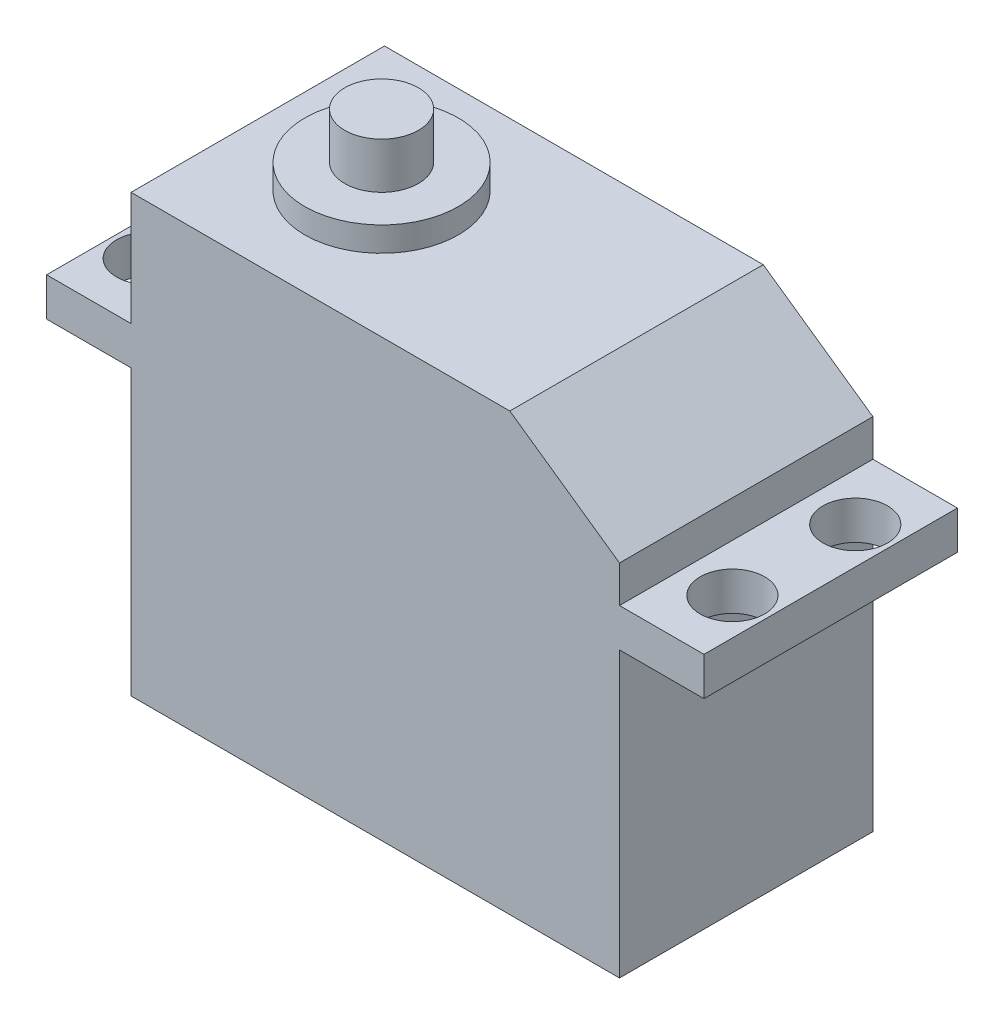
ISO-10303-21;
HEADER;
FILE_DESCRIPTION(('STEP AP214'),'2;1');
FILE_NAME('part.step','',(''),(''),'','','');
FILE_SCHEMA(('AUTOMOTIVE_DESIGN { 1 0 10303 214 1 1 1 1 }'));
ENDSEC;
DATA;
#1=APPLICATION_CONTEXT('core data for automotive mechanical design processes');
#2=APPLICATION_PROTOCOL_DEFINITION('international standard','automotive_design',2000,#1);
#3=PRODUCT_CONTEXT('',#1,'mechanical');
#4=PRODUCT('Part','Part','',(#3));
#5=PRODUCT_RELATED_PRODUCT_CATEGORY('part','',(#4));
#6=PRODUCT_DEFINITION_FORMATION('','',#4);
#7=PRODUCT_DEFINITION_CONTEXT('part definition',#1,'design');
#8=PRODUCT_DEFINITION('design','',#6,#7);
#9=PRODUCT_DEFINITION_SHAPE('','',#8);
#10=(LENGTH_UNIT() NAMED_UNIT(*) SI_UNIT(.MILLI.,.METRE.));
#11=(NAMED_UNIT(*) PLANE_ANGLE_UNIT() SI_UNIT($,.RADIAN.));
#12=(NAMED_UNIT(*) SI_UNIT($,.STERADIAN.) SOLID_ANGLE_UNIT());
#13=UNCERTAINTY_MEASURE_WITH_UNIT(LENGTH_MEASURE(1.E-05),#10,'distance_accuracy_value','');
#14=(GEOMETRIC_REPRESENTATION_CONTEXT(3) GLOBAL_UNCERTAINTY_ASSIGNED_CONTEXT((#13)) GLOBAL_UNIT_ASSIGNED_CONTEXT((#10,
#11,#12)) REPRESENTATION_CONTEXT('',''));
#15=CARTESIAN_POINT('',(0.,0.,0.));
#16=DIRECTION('',(0.,0.,1.));
#17=DIRECTION('',(1.,0.,0.));
#18=AXIS2_PLACEMENT_3D('',#15,#16,#17);
#19=CARTESIAN_POINT('',(-15.9,28.4,-8.25));
#20=DIRECTION('',(1.,0.,0.));
#21=DIRECTION('',(0.,0.,-1.));
#22=AXIS2_PLACEMENT_3D('',#19,#20,#21);
#23=PLANE('',#22);
#24=DIRECTION('',(0.,-1.,0.));
#25=VECTOR('',#24,1.);
#26=CARTESIAN_POINT('',(-15.9,28.4,8.25));
#27=LINE('',#26,#25);
#28=CARTESIAN_POINT('',(-15.9,18.5,8.25));
#29=VERTEX_POINT('',#28);
#30=CARTESIAN_POINT('',(-15.9,0.,8.25));
#31=VERTEX_POINT('',#30);
#32=EDGE_CURVE('E216',#29,#31,#27,.T.);
#33=ORIENTED_EDGE('',*,*,#32,.F.);
#34=DIRECTION('',(0.,0.,-1.));
#35=VECTOR('',#34,1.);
#36=CARTESIAN_POINT('',(-15.9,18.5,8.25));
#37=LINE('',#36,#35);
#38=CARTESIAN_POINT('',(-15.9,18.5,-8.25));
#39=VERTEX_POINT('',#38);
#40=EDGE_CURVE('E149',#29,#39,#37,.T.);
#41=ORIENTED_EDGE('',*,*,#40,.T.);
#42=DIRECTION('',(0.,-1.,0.));
#43=VECTOR('',#42,1.);
#44=CARTESIAN_POINT('',(-15.9,28.4,-8.25));
#45=LINE('',#44,#43);
#46=CARTESIAN_POINT('',(-15.9,0.,-8.25));
#47=VERTEX_POINT('',#46);
#48=EDGE_CURVE('E218',#39,#47,#45,.T.);
#49=ORIENTED_EDGE('',*,*,#48,.T.);
#50=DIRECTION('',(0.,0.,1.));
#51=VECTOR('',#50,1.);
#52=CARTESIAN_POINT('',(-15.9,0.,-8.25));
#53=LINE('',#52,#51);
#54=EDGE_CURVE('E209',#47,#31,#53,.T.);
#55=ORIENTED_EDGE('',*,*,#54,.T.);
#56=EDGE_LOOP('',(#33,#41,#49,#55));
#57=FACE_BOUND('',#56,.T.);
#58=ADVANCED_FACE('F33',(#57),#23,.F.);
#59=CARTESIAN_POINT('',(15.9,28.4,-8.25));
#60=DIRECTION('',(-1.,0.,0.));
#61=DIRECTION('',(0.,0.,1.));
#62=AXIS2_PLACEMENT_3D('',#59,#60,#61);
#63=PLANE('',#62);
#64=DIRECTION('',(0.,-1.,0.));
#65=VECTOR('',#64,1.);
#66=CARTESIAN_POINT('',(15.9,28.4,-8.25));
#67=LINE('',#66,#65);
#68=CARTESIAN_POINT('',(15.9,23.4,-8.25));
#69=VERTEX_POINT('',#68);
#70=CARTESIAN_POINT('',(15.9,21.,-8.25));
#71=VERTEX_POINT('',#70);
#72=EDGE_CURVE('E223',#69,#71,#67,.T.);
#73=ORIENTED_EDGE('',*,*,#72,.F.);
#74=DIRECTION('',(0.,0.,1.));
#75=VECTOR('',#74,1.);
#76=CARTESIAN_POINT('',(15.9,23.4,8.25));
#77=LINE('',#76,#75);
#78=CARTESIAN_POINT('',(15.9,23.4,8.25));
#79=VERTEX_POINT('',#78);
#80=EDGE_CURVE('E41',#69,#79,#77,.T.);
#81=ORIENTED_EDGE('',*,*,#80,.T.);
#82=DIRECTION('',(0.,-1.,0.));
#83=VECTOR('',#82,1.);
#84=CARTESIAN_POINT('',(15.9,28.4,8.25));
#85=LINE('',#84,#83);
#86=CARTESIAN_POINT('',(15.9,21.,8.25));
#87=VERTEX_POINT('',#86);
#88=EDGE_CURVE('E214',#79,#87,#85,.T.);
#89=ORIENTED_EDGE('',*,*,#88,.T.);
#90=DIRECTION('',(0.,0.,1.));
#91=VECTOR('',#90,1.);
#92=CARTESIAN_POINT('',(15.9,21.,8.25));
#93=LINE('',#92,#91);
#94=EDGE_CURVE('E172',#71,#87,#93,.T.);
#95=ORIENTED_EDGE('',*,*,#94,.F.);
#96=EDGE_LOOP('',(#73,#81,#89,#95));
#97=FACE_BOUND('',#96,.T.);
#98=ADVANCED_FACE('F285',(#97),#63,.F.);
#99=DIRECTION('',(0.,0.,-1.));
#100=VECTOR('',#99,1.);
#101=CARTESIAN_POINT('',(15.9,18.5,8.25));
#102=LINE('',#101,#100);
#103=CARTESIAN_POINT('',(15.9,18.5,8.25));
#104=VERTEX_POINT('',#103);
#105=CARTESIAN_POINT('',(15.9,18.5,-8.25));
#106=VERTEX_POINT('',#105);
#107=EDGE_CURVE('E138',#104,#106,#102,.T.);
#108=ORIENTED_EDGE('',*,*,#107,.F.);
#109=CARTESIAN_POINT('',(15.9,0.,8.25));
#110=VERTEX_POINT('',#109);
#111=EDGE_CURVE('E203',#104,#110,#85,.T.);
#112=ORIENTED_EDGE('',*,*,#111,.T.);
#113=DIRECTION('',(0.,0.,-1.));
#114=VECTOR('',#113,1.);
#115=CARTESIAN_POINT('',(15.9,0.,-8.25));
#116=LINE('',#115,#114);
#117=CARTESIAN_POINT('',(15.9,0.,-8.25));
#118=VERTEX_POINT('',#117);
#119=EDGE_CURVE('E194',#110,#118,#116,.T.);
#120=ORIENTED_EDGE('',*,*,#119,.T.);
#121=EDGE_CURVE('E222',#106,#118,#67,.T.);
#122=ORIENTED_EDGE('',*,*,#121,.F.);
#123=EDGE_LOOP('',(#108,#112,#120,#122));
#124=FACE_BOUND('',#123,.T.);
#125=ADVANCED_FACE('F292',(#124),#63,.F.);
#126=CARTESIAN_POINT('',(-15.9,28.4,-8.25));
#127=DIRECTION('',(0.,0.,1.));
#128=DIRECTION('',(1.,0.,0.));
#129=AXIS2_PLACEMENT_3D('',#126,#127,#128);
#130=PLANE('',#129);
#131=DIRECTION('',(-1.,0.,0.));
#132=VECTOR('',#131,1.);
#133=CARTESIAN_POINT('',(-15.9,28.4,-8.25));
#134=LINE('',#133,#132);
#135=CARTESIAN_POINT('',(8.75925996628941,28.4,-8.25));
#136=VERTEX_POINT('',#135);
#137=CARTESIAN_POINT('',(-15.9,28.4,-8.25));
#138=VERTEX_POINT('',#137);
#139=EDGE_CURVE('E195',#136,#138,#134,.T.);
#140=ORIENTED_EDGE('',*,*,#139,.F.);
#141=DIRECTION('',(0.819152044288991,-0.573576436351047,0.));
#142=VECTOR('',#141,1.);
#143=CARTESIAN_POINT('',(8.75925996628942,28.4,-8.25));
#144=LINE('',#143,#142);
#145=EDGE_CURVE('E55',#136,#69,#144,.T.);
#146=ORIENTED_EDGE('',*,*,#145,.T.);
#147=ORIENTED_EDGE('',*,*,#72,.T.);
#148=DIRECTION('',(-1.,0.,0.));
#149=VECTOR('',#148,1.);
#150=CARTESIAN_POINT('',(21.4,21.,-8.25000000000001));
#151=LINE('',#150,#149);
#152=CARTESIAN_POINT('',(21.4,21.,-8.25000000000001));
#153=VERTEX_POINT('',#152);
#154=EDGE_CURVE('E185',#153,#71,#151,.T.);
#155=ORIENTED_EDGE('',*,*,#154,.F.);
#156=DIRECTION('',(0.,1.,0.));
#157=VECTOR('',#156,1.);
#158=CARTESIAN_POINT('',(21.4,18.5,-8.25000000000001));
#159=LINE('',#158,#157);
#160=CARTESIAN_POINT('',(21.4,18.5,-8.25000000000001));
#161=VERTEX_POINT('',#160);
#162=EDGE_CURVE('E174',#161,#153,#159,.T.);
#163=ORIENTED_EDGE('',*,*,#162,.F.);
#164=DIRECTION('',(-1.,0.,0.));
#165=VECTOR('',#164,1.);
#166=CARTESIAN_POINT('',(21.4,18.5,-8.25000000000001));
#167=LINE('',#166,#165);
#168=EDGE_CURVE('E188',#161,#106,#167,.T.);
#169=ORIENTED_EDGE('',*,*,#168,.T.);
#170=ORIENTED_EDGE('',*,*,#121,.T.);
#171=DIRECTION('',(-1.,0.,0.));
#172=VECTOR('',#171,1.);
#173=CARTESIAN_POINT('',(-15.9,0.,-8.25));
#174=LINE('',#173,#172);
#175=EDGE_CURVE('E206',#118,#47,#174,.T.);
#176=ORIENTED_EDGE('',*,*,#175,.T.);
#177=ORIENTED_EDGE('',*,*,#48,.F.);
#178=DIRECTION('',(1.,0.,0.));
#179=VECTOR('',#178,1.);
#180=CARTESIAN_POINT('',(-21.4,18.5,-8.25000000000001));
#181=LINE('',#180,#179);
#182=CARTESIAN_POINT('',(-21.4,18.5,-8.25000000000001));
#183=VERTEX_POINT('',#182);
#184=EDGE_CURVE('E165',#183,#39,#181,.T.);
#185=ORIENTED_EDGE('',*,*,#184,.F.);
#186=DIRECTION('',(0.,1.,0.));
#187=VECTOR('',#186,1.);
#188=CARTESIAN_POINT('',(-21.4,18.5,-8.25000000000001));
#189=LINE('',#188,#187);
#190=CARTESIAN_POINT('',(-21.4,21.,-8.25000000000001));
#191=VERTEX_POINT('',#190);
#192=EDGE_CURVE('E152',#183,#191,#189,.T.);
#193=ORIENTED_EDGE('',*,*,#192,.T.);
#194=DIRECTION('',(1.,0.,0.));
#195=VECTOR('',#194,1.);
#196=CARTESIAN_POINT('',(-21.4,21.,-8.25000000000001));
#197=LINE('',#196,#195);
#198=CARTESIAN_POINT('',(-15.9,21.,-8.25));
#199=VERTEX_POINT('',#198);
#200=EDGE_CURVE('E139',#191,#199,#197,.T.);
#201=ORIENTED_EDGE('',*,*,#200,.T.);
#202=EDGE_CURVE('E219',#138,#199,#45,.T.);
#203=ORIENTED_EDGE('',*,*,#202,.F.);
#204=EDGE_LOOP('',(#140,#146,#147,#155,#163,#169,#170,#176,#177,#185,#193,#201,#203));
#205=FACE_BOUND('',#204,.T.);
#206=ADVANCED_FACE('F297',(#205),#130,.F.);
#207=ORIENTED_EDGE('',*,*,#202,.T.);
#208=DIRECTION('',(0.,0.,1.));
#209=VECTOR('',#208,1.);
#210=CARTESIAN_POINT('',(-15.9,21.,8.25));
#211=LINE('',#210,#209);
#212=CARTESIAN_POINT('',(-15.9,21.,8.25));
#213=VERTEX_POINT('',#212);
#214=EDGE_CURVE('E159',#199,#213,#211,.T.);
#215=ORIENTED_EDGE('',*,*,#214,.T.);
#216=CARTESIAN_POINT('',(-15.9,28.4,8.25));
#217=VERTEX_POINT('',#216);
#218=EDGE_CURVE('E133',#217,#213,#27,.T.);
#219=ORIENTED_EDGE('',*,*,#218,.F.);
#220=DIRECTION('',(0.,0.,1.));
#221=VECTOR('',#220,1.);
#222=CARTESIAN_POINT('',(-15.9,28.4,-8.25));
#223=LINE('',#222,#221);
#224=EDGE_CURVE('E197',#138,#217,#223,.T.);
#225=ORIENTED_EDGE('',*,*,#224,.F.);
#226=EDGE_LOOP('',(#207,#215,#219,#225));
#227=FACE_BOUND('',#226,.T.);
#228=ADVANCED_FACE('F288',(#227),#23,.F.);
#229=CARTESIAN_POINT('',(-15.9,28.4,8.25));
#230=DIRECTION('',(0.,0.,-1.));
#231=DIRECTION('',(-1.,0.,0.));
#232=AXIS2_PLACEMENT_3D('',#229,#230,#231);
#233=PLANE('',#232);
#234=ORIENTED_EDGE('',*,*,#88,.F.);
#235=DIRECTION('',(-0.819152044288991,0.573576436351047,0.));
#236=VECTOR('',#235,1.);
#237=CARTESIAN_POINT('',(8.75925996628942,28.4,8.25));
#238=LINE('',#237,#236);
#239=CARTESIAN_POINT('',(8.75925996628942,28.4,8.25));
#240=VERTEX_POINT('',#239);
#241=EDGE_CURVE('E11',#79,#240,#238,.T.);
#242=ORIENTED_EDGE('',*,*,#241,.T.);
#243=DIRECTION('',(1.,0.,0.));
#244=VECTOR('',#243,1.);
#245=CARTESIAN_POINT('',(-15.9,28.4,8.25));
#246=LINE('',#245,#244);
#247=EDGE_CURVE('E200',#217,#240,#246,.T.);
#248=ORIENTED_EDGE('',*,*,#247,.F.);
#249=ORIENTED_EDGE('',*,*,#218,.T.);
#250=DIRECTION('',(1.,0.,0.));
#251=VECTOR('',#250,1.);
#252=CARTESIAN_POINT('',(-21.4,21.,8.24999999999999));
#253=LINE('',#252,#251);
#254=CARTESIAN_POINT('',(-21.4,21.,8.24999999999999));
#255=VERTEX_POINT('',#254);
#256=EDGE_CURVE('E126',#255,#213,#253,.T.);
#257=ORIENTED_EDGE('',*,*,#256,.F.);
#258=DIRECTION('',(0.,-1.,0.));
#259=VECTOR('',#258,1.);
#260=CARTESIAN_POINT('',(-21.4,18.5,8.24999999999999));
#261=LINE('',#260,#259);
#262=CARTESIAN_POINT('',(-21.4,18.5,8.24999999999999));
#263=VERTEX_POINT('',#262);
#264=EDGE_CURVE('E129',#255,#263,#261,.T.);
#265=ORIENTED_EDGE('',*,*,#264,.T.);
#266=DIRECTION('',(1.,0.,0.));
#267=VECTOR('',#266,1.);
#268=CARTESIAN_POINT('',(-21.4,18.5,8.24999999999999));
#269=LINE('',#268,#267);
#270=EDGE_CURVE('E158',#263,#29,#269,.T.);
#271=ORIENTED_EDGE('',*,*,#270,.T.);
#272=ORIENTED_EDGE('',*,*,#32,.T.);
#273=DIRECTION('',(1.,0.,0.));
#274=VECTOR('',#273,1.);
#275=CARTESIAN_POINT('',(-15.9,0.,8.25));
#276=LINE('',#275,#274);
#277=EDGE_CURVE('E198',#31,#110,#276,.T.);
#278=ORIENTED_EDGE('',*,*,#277,.T.);
#279=ORIENTED_EDGE('',*,*,#111,.F.);
#280=DIRECTION('',(-1.,0.,0.));
#281=VECTOR('',#280,1.);
#282=CARTESIAN_POINT('',(21.4,18.5,8.24999999999999));
#283=LINE('',#282,#281);
#284=CARTESIAN_POINT('',(21.4,18.5,8.24999999999999));
#285=VERTEX_POINT('',#284);
#286=EDGE_CURVE('E191',#285,#104,#283,.T.);
#287=ORIENTED_EDGE('',*,*,#286,.F.);
#288=DIRECTION('',(0.,-1.,0.));
#289=VECTOR('',#288,1.);
#290=CARTESIAN_POINT('',(21.4,18.5,8.24999999999999));
#291=LINE('',#290,#289);
#292=CARTESIAN_POINT('',(21.4,21.,8.24999999999999));
#293=VERTEX_POINT('',#292);
#294=EDGE_CURVE('E168',#293,#285,#291,.T.);
#295=ORIENTED_EDGE('',*,*,#294,.F.);
#296=DIRECTION('',(-1.,0.,0.));
#297=VECTOR('',#296,1.);
#298=CARTESIAN_POINT('',(21.4,21.,8.24999999999999));
#299=LINE('',#298,#297);
#300=EDGE_CURVE('E178',#293,#87,#299,.T.);
#301=ORIENTED_EDGE('',*,*,#300,.T.);
#302=EDGE_LOOP('',(#234,#242,#248,#249,#257,#265,#271,#272,#278,#279,#287,#295,#301));
#303=FACE_BOUND('',#302,.T.);
#304=ADVANCED_FACE('F128',(#303),#233,.F.);
#305=CARTESIAN_POINT('',(0.,28.4,0.));
#306=DIRECTION('',(0.,1.,0.));
#307=DIRECTION('',(0.,0.,1.));
#308=AXIS2_PLACEMENT_3D('',#305,#306,#307);
#309=PLANE('',#308);
#310=CARTESIAN_POINT('',(-7.84,28.4,0.));
#311=DIRECTION('',(0.,1.,0.));
#312=DIRECTION('',(0.,0.,1.));
#313=AXIS2_PLACEMENT_3D('',#310,#311,#312);
#314=CIRCLE('',#313,5.);
#315=CARTESIAN_POINT('',(-7.84,28.4,5.));
#316=VERTEX_POINT('',#315);
#317=EDGE_CURVE('E242',#316,#316,#314,.T.);
#318=ORIENTED_EDGE('',*,*,#317,.F.);
#319=EDGE_LOOP('',(#318));
#320=FACE_BOUND('',#319,.T.);
#321=ORIENTED_EDGE('',*,*,#247,.T.);
#322=DIRECTION('',(0.,0.,-1.));
#323=VECTOR('',#322,1.);
#324=CARTESIAN_POINT('',(8.75925996628941,28.4,-8.25));
#325=LINE('',#324,#323);
#326=EDGE_CURVE('E226',#240,#136,#325,.T.);
#327=ORIENTED_EDGE('',*,*,#326,.T.);
#328=ORIENTED_EDGE('',*,*,#139,.T.);
#329=ORIENTED_EDGE('',*,*,#224,.T.);
#330=EDGE_LOOP('',(#321,#327,#328,#329));
#331=FACE_BOUND('',#330,.T.);
#332=ADVANCED_FACE('F303',(#320,#331),#309,.T.);
#333=CARTESIAN_POINT('',(0.,0.,0.));
#334=DIRECTION('',(0.,1.,0.));
#335=DIRECTION('',(0.,0.,1.));
#336=AXIS2_PLACEMENT_3D('',#333,#334,#335);
#337=PLANE('',#336);
#338=ORIENTED_EDGE('',*,*,#119,.F.);
#339=ORIENTED_EDGE('',*,*,#277,.F.);
#340=ORIENTED_EDGE('',*,*,#54,.F.);
#341=ORIENTED_EDGE('',*,*,#175,.F.);
#342=EDGE_LOOP('',(#338,#339,#340,#341));
#343=FACE_BOUND('',#342,.T.);
#344=ADVANCED_FACE('F314',(#343),#337,.F.);
#345=CARTESIAN_POINT('',(21.4,18.5,8.24999999999999));
#346=DIRECTION('',(0.,1.,0.));
#347=DIRECTION('',(0.,0.,1.));
#348=AXIS2_PLACEMENT_3D('',#345,#346,#347);
#349=PLANE('',#348);
#350=CARTESIAN_POINT('',(19.,18.5,-4.));
#351=DIRECTION('',(0.,-1.,0.));
#352=DIRECTION('',(0.,0.,-1.));
#353=AXIS2_PLACEMENT_3D('',#350,#351,#352);
#354=CIRCLE('',#353,2.1);
#355=CARTESIAN_POINT('',(19.,18.5,-6.1));
#356=VERTEX_POINT('',#355);
#357=EDGE_CURVE('E255',#356,#356,#354,.F.);
#358=ORIENTED_EDGE('',*,*,#357,.T.);
#359=EDGE_LOOP('',(#358));
#360=FACE_BOUND('',#359,.T.);
#361=CARTESIAN_POINT('',(19.,18.5,4.));
#362=DIRECTION('',(0.,-1.,0.));
#363=DIRECTION('',(0.,0.,-1.));
#364=AXIS2_PLACEMENT_3D('',#361,#362,#363);
#365=CIRCLE('',#364,2.1);
#366=CARTESIAN_POINT('',(19.,18.5,1.9));
#367=VERTEX_POINT('',#366);
#368=EDGE_CURVE('E247',#367,#367,#365,.F.);
#369=ORIENTED_EDGE('',*,*,#368,.T.);
#370=EDGE_LOOP('',(#369));
#371=FACE_BOUND('',#370,.T.);
#372=ORIENTED_EDGE('',*,*,#107,.T.);
#373=ORIENTED_EDGE('',*,*,#168,.F.);
#374=DIRECTION('',(0.,0.,-1.));
#375=VECTOR('',#374,1.);
#376=CARTESIAN_POINT('',(21.4,18.5,8.24999999999999));
#377=LINE('',#376,#375);
#378=EDGE_CURVE('E171',#285,#161,#377,.T.);
#379=ORIENTED_EDGE('',*,*,#378,.F.);
#380=ORIENTED_EDGE('',*,*,#286,.T.);
#381=EDGE_LOOP('',(#372,#373,#379,#380));
#382=FACE_BOUND('',#381,.T.);
#383=ADVANCED_FACE('F319',(#360,#371,#382),#349,.F.);
#384=CARTESIAN_POINT('',(21.4,21.,8.24999999999999));
#385=DIRECTION('',(0.,-1.,0.));
#386=DIRECTION('',(0.,0.,-1.));
#387=AXIS2_PLACEMENT_3D('',#384,#385,#386);
#388=PLANE('',#387);
#389=CARTESIAN_POINT('',(19.,21.,-4.));
#390=DIRECTION('',(0.,1.,0.));
#391=DIRECTION('',(0.,0.,1.));
#392=AXIS2_PLACEMENT_3D('',#389,#390,#391);
#393=CIRCLE('',#392,2.1);
#394=CARTESIAN_POINT('',(19.,21.,-1.9));
#395=VERTEX_POINT('',#394);
#396=EDGE_CURVE('E250',#395,#395,#393,.T.);
#397=ORIENTED_EDGE('',*,*,#396,.F.);
#398=EDGE_LOOP('',(#397));
#399=FACE_BOUND('',#398,.T.);
#400=CARTESIAN_POINT('',(19.,21.,4.));
#401=DIRECTION('',(0.,1.,0.));
#402=DIRECTION('',(0.,0.,1.));
#403=AXIS2_PLACEMENT_3D('',#400,#401,#402);
#404=CIRCLE('',#403,2.1);
#405=CARTESIAN_POINT('',(19.,21.,6.1));
#406=VERTEX_POINT('',#405);
#407=EDGE_CURVE('E241',#406,#406,#404,.T.);
#408=ORIENTED_EDGE('',*,*,#407,.F.);
#409=EDGE_LOOP('',(#408));
#410=FACE_BOUND('',#409,.T.);
#411=ORIENTED_EDGE('',*,*,#94,.T.);
#412=ORIENTED_EDGE('',*,*,#300,.F.);
#413=DIRECTION('',(0.,0.,1.));
#414=VECTOR('',#413,1.);
#415=CARTESIAN_POINT('',(21.4,21.,8.24999999999999));
#416=LINE('',#415,#414);
#417=EDGE_CURVE('E176',#153,#293,#416,.T.);
#418=ORIENTED_EDGE('',*,*,#417,.F.);
#419=ORIENTED_EDGE('',*,*,#154,.T.);
#420=EDGE_LOOP('',(#411,#412,#418,#419));
#421=FACE_BOUND('',#420,.T.);
#422=ADVANCED_FACE('F328',(#399,#410,#421),#388,.F.);
#423=CARTESIAN_POINT('',(21.4,0.,0.));
#424=DIRECTION('',(-1.,0.,0.));
#425=DIRECTION('',(0.,0.,1.));
#426=AXIS2_PLACEMENT_3D('',#423,#424,#425);
#427=PLANE('',#426);
#428=ORIENTED_EDGE('',*,*,#294,.T.);
#429=ORIENTED_EDGE('',*,*,#378,.T.);
#430=ORIENTED_EDGE('',*,*,#162,.T.);
#431=ORIENTED_EDGE('',*,*,#417,.T.);
#432=EDGE_LOOP('',(#428,#429,#430,#431));
#433=FACE_BOUND('',#432,.T.);
#434=ADVANCED_FACE('F323',(#433),#427,.F.);
#435=CARTESIAN_POINT('',(-21.4,21.,8.24999999999999));
#436=DIRECTION('',(0.,1.,0.));
#437=DIRECTION('',(0.,0.,1.));
#438=AXIS2_PLACEMENT_3D('',#435,#436,#437);
#439=PLANE('',#438);
#440=CARTESIAN_POINT('',(-19.,21.,4.));
#441=DIRECTION('',(0.,1.,0.));
#442=DIRECTION('',(0.,0.,1.));
#443=AXIS2_PLACEMENT_3D('',#440,#441,#442);
#444=CIRCLE('',#443,2.1);
#445=CARTESIAN_POINT('',(-19.,21.,6.1));
#446=VERTEX_POINT('',#445);
#447=EDGE_CURVE('E251',#446,#446,#444,.T.);
#448=ORIENTED_EDGE('',*,*,#447,.F.);
#449=EDGE_LOOP('',(#448));
#450=FACE_BOUND('',#449,.T.);
#451=CARTESIAN_POINT('',(-19.,21.,-4.));
#452=DIRECTION('',(0.,1.,0.));
#453=DIRECTION('',(0.,0.,1.));
#454=AXIS2_PLACEMENT_3D('',#451,#452,#453);
#455=CIRCLE('',#454,2.1);
#456=CARTESIAN_POINT('',(-19.,21.,-1.9));
#457=VERTEX_POINT('',#456);
#458=EDGE_CURVE('E258',#457,#457,#455,.T.);
#459=ORIENTED_EDGE('',*,*,#458,.F.);
#460=EDGE_LOOP('',(#459));
#461=FACE_BOUND('',#460,.T.);
#462=ORIENTED_EDGE('',*,*,#214,.F.);
#463=ORIENTED_EDGE('',*,*,#200,.F.);
#464=DIRECTION('',(0.,0.,1.));
#465=VECTOR('',#464,1.);
#466=CARTESIAN_POINT('',(-21.4,21.,8.24999999999999));
#467=LINE('',#466,#465);
#468=EDGE_CURVE('E145',#191,#255,#467,.T.);
#469=ORIENTED_EDGE('',*,*,#468,.T.);
#470=ORIENTED_EDGE('',*,*,#256,.T.);
#471=EDGE_LOOP('',(#462,#463,#469,#470));
#472=FACE_BOUND('',#471,.T.);
#473=ADVANCED_FACE('F151',(#450,#461,#472),#439,.T.);
#474=CARTESIAN_POINT('',(-21.4,18.5,8.24999999999999));
#475=DIRECTION('',(0.,-1.,0.));
#476=DIRECTION('',(0.,0.,-1.));
#477=AXIS2_PLACEMENT_3D('',#474,#475,#476);
#478=PLANE('',#477);
#479=CARTESIAN_POINT('',(-19.,18.5,4.));
#480=DIRECTION('',(0.,-1.,0.));
#481=DIRECTION('',(0.,0.,-1.));
#482=AXIS2_PLACEMENT_3D('',#479,#480,#481);
#483=CIRCLE('',#482,2.1);
#484=CARTESIAN_POINT('',(-19.,18.5,1.9));
#485=VERTEX_POINT('',#484);
#486=EDGE_CURVE('E254',#485,#485,#483,.F.);
#487=ORIENTED_EDGE('',*,*,#486,.T.);
#488=EDGE_LOOP('',(#487));
#489=FACE_BOUND('',#488,.T.);
#490=CARTESIAN_POINT('',(-19.,18.5,-4.));
#491=DIRECTION('',(0.,-1.,0.));
#492=DIRECTION('',(0.,0.,-1.));
#493=AXIS2_PLACEMENT_3D('',#490,#491,#492);
#494=CIRCLE('',#493,2.1);
#495=CARTESIAN_POINT('',(-19.,18.5,-6.1));
#496=VERTEX_POINT('',#495);
#497=EDGE_CURVE('E161',#496,#496,#494,.F.);
#498=ORIENTED_EDGE('',*,*,#497,.T.);
#499=EDGE_LOOP('',(#498));
#500=FACE_BOUND('',#499,.T.);
#501=ORIENTED_EDGE('',*,*,#40,.F.);
#502=ORIENTED_EDGE('',*,*,#270,.F.);
#503=DIRECTION('',(0.,0.,-1.));
#504=VECTOR('',#503,1.);
#505=CARTESIAN_POINT('',(-21.4,18.5,8.24999999999999));
#506=LINE('',#505,#504);
#507=EDGE_CURVE('E148',#263,#183,#506,.T.);
#508=ORIENTED_EDGE('',*,*,#507,.T.);
#509=ORIENTED_EDGE('',*,*,#184,.T.);
#510=EDGE_LOOP('',(#501,#502,#508,#509));
#511=FACE_BOUND('',#510,.T.);
#512=ADVANCED_FACE('F267',(#489,#500,#511),#478,.T.);
#513=CARTESIAN_POINT('',(-21.4,0.,0.));
#514=DIRECTION('',(1.,0.,0.));
#515=DIRECTION('',(0.,0.,1.));
#516=AXIS2_PLACEMENT_3D('',#513,#514,#515);
#517=PLANE('',#516);
#518=ORIENTED_EDGE('',*,*,#264,.F.);
#519=ORIENTED_EDGE('',*,*,#468,.F.);
#520=ORIENTED_EDGE('',*,*,#192,.F.);
#521=ORIENTED_EDGE('',*,*,#507,.F.);
#522=EDGE_LOOP('',(#518,#519,#520,#521));
#523=FACE_BOUND('',#522,.T.);
#524=ADVANCED_FACE('F143',(#523),#517,.F.);
#525=CARTESIAN_POINT('',(-19.,12.560303038033,-4.));
#526=DIRECTION('',(0.,1.,0.));
#527=DIRECTION('',(0.,0.,1.));
#528=AXIS2_PLACEMENT_3D('',#525,#526,#527);
#529=CYLINDRICAL_SURFACE('',#528,2.1);
#530=ORIENTED_EDGE('',*,*,#458,.T.);
#531=EDGE_LOOP('',(#530));
#532=FACE_BOUND('',#531,.T.);
#533=ORIENTED_EDGE('',*,*,#497,.F.);
#534=EDGE_LOOP('',(#533));
#535=FACE_BOUND('',#534,.T.);
#536=ADVANCED_FACE('F270',(#532,#535),#529,.F.);
#537=CARTESIAN_POINT('',(-19.,12.560303038033,4.));
#538=DIRECTION('',(0.,1.,0.));
#539=DIRECTION('',(0.,0.,1.));
#540=AXIS2_PLACEMENT_3D('',#537,#538,#539);
#541=CYLINDRICAL_SURFACE('',#540,2.1);
#542=ORIENTED_EDGE('',*,*,#447,.T.);
#543=EDGE_LOOP('',(#542));
#544=FACE_BOUND('',#543,.T.);
#545=ORIENTED_EDGE('',*,*,#486,.F.);
#546=EDGE_LOOP('',(#545));
#547=FACE_BOUND('',#546,.T.);
#548=ADVANCED_FACE('F272',(#544,#547),#541,.F.);
#549=CARTESIAN_POINT('',(19.,12.560303038033,4.));
#550=DIRECTION('',(0.,1.,0.));
#551=DIRECTION('',(0.,0.,1.));
#552=AXIS2_PLACEMENT_3D('',#549,#550,#551);
#553=CYLINDRICAL_SURFACE('',#552,2.1);
#554=ORIENTED_EDGE('',*,*,#407,.T.);
#555=EDGE_LOOP('',(#554));
#556=FACE_BOUND('',#555,.T.);
#557=ORIENTED_EDGE('',*,*,#368,.F.);
#558=EDGE_LOOP('',(#557));
#559=FACE_BOUND('',#558,.T.);
#560=ADVANCED_FACE('F279',(#556,#559),#553,.F.);
#561=CARTESIAN_POINT('',(19.,12.560303038033,-4.));
#562=DIRECTION('',(0.,1.,0.));
#563=DIRECTION('',(0.,0.,1.));
#564=AXIS2_PLACEMENT_3D('',#561,#562,#563);
#565=CYLINDRICAL_SURFACE('',#564,2.1);
#566=ORIENTED_EDGE('',*,*,#396,.T.);
#567=EDGE_LOOP('',(#566));
#568=FACE_BOUND('',#567,.T.);
#569=ORIENTED_EDGE('',*,*,#357,.F.);
#570=EDGE_LOOP('',(#569));
#571=FACE_BOUND('',#570,.T.);
#572=ADVANCED_FACE('F478',(#568,#571),#565,.F.);
#573=CARTESIAN_POINT('',(-7.84,30.,0.));
#574=DIRECTION('',(0.,-1.,0.));
#575=DIRECTION('',(0.,0.,-1.));
#576=AXIS2_PLACEMENT_3D('',#573,#574,#575);
#577=CYLINDRICAL_SURFACE('',#576,5.);
#578=CARTESIAN_POINT('',(-7.84,30.,0.));
#579=DIRECTION('',(0.,1.,0.));
#580=DIRECTION('',(0.,0.,1.));
#581=AXIS2_PLACEMENT_3D('',#578,#579,#580);
#582=CIRCLE('',#581,5.);
#583=CARTESIAN_POINT('',(-7.84,30.,5.));
#584=VERTEX_POINT('',#583);
#585=EDGE_CURVE('E238',#584,#584,#582,.T.);
#586=ORIENTED_EDGE('',*,*,#585,.F.);
#587=EDGE_LOOP('',(#586));
#588=FACE_BOUND('',#587,.T.);
#589=ORIENTED_EDGE('',*,*,#317,.T.);
#590=EDGE_LOOP('',(#589));
#591=FACE_BOUND('',#590,.T.);
#592=ADVANCED_FACE('F470',(#588,#591),#577,.T.);
#593=CARTESIAN_POINT('',(-7.84,30.,0.));
#594=DIRECTION('',(0.,1.,0.));
#595=DIRECTION('',(0.,0.,1.));
#596=AXIS2_PLACEMENT_3D('',#593,#594,#595);
#597=PLANE('',#596);
#598=CARTESIAN_POINT('',(-7.84,30.,0.));
#599=DIRECTION('',(0.,1.,0.));
#600=DIRECTION('',(0.,0.,1.));
#601=AXIS2_PLACEMENT_3D('',#598,#599,#600);
#602=CIRCLE('',#601,2.4);
#603=CARTESIAN_POINT('',(-7.84,30.,2.4));
#604=VERTEX_POINT('',#603);
#605=EDGE_CURVE('E225',#604,#604,#602,.T.);
#606=ORIENTED_EDGE('',*,*,#605,.F.);
#607=EDGE_LOOP('',(#606));
#608=FACE_BOUND('',#607,.T.);
#609=ORIENTED_EDGE('',*,*,#585,.T.);
#610=EDGE_LOOP('',(#609));
#611=FACE_BOUND('',#610,.T.);
#612=ADVANCED_FACE('F462',(#608,#611),#597,.T.);
#613=CARTESIAN_POINT('',(-7.84,33.,0.));
#614=DIRECTION('',(0.,-1.,0.));
#615=DIRECTION('',(0.,0.,-1.));
#616=AXIS2_PLACEMENT_3D('',#613,#614,#615);
#617=CYLINDRICAL_SURFACE('',#616,2.4);
#618=CARTESIAN_POINT('',(-7.84,33.,0.));
#619=DIRECTION('',(0.,1.,0.));
#620=DIRECTION('',(0.,0.,1.));
#621=AXIS2_PLACEMENT_3D('',#618,#619,#620);
#622=CIRCLE('',#621,2.4);
#623=CARTESIAN_POINT('',(-7.84,33.,2.4));
#624=VERTEX_POINT('',#623);
#625=EDGE_CURVE('E237',#624,#624,#622,.T.);
#626=ORIENTED_EDGE('',*,*,#625,.F.);
#627=EDGE_LOOP('',(#626));
#628=FACE_BOUND('',#627,.T.);
#629=ORIENTED_EDGE('',*,*,#605,.T.);
#630=EDGE_LOOP('',(#629));
#631=FACE_BOUND('',#630,.T.);
#632=ADVANCED_FACE('F455',(#628,#631),#617,.T.);
#633=CARTESIAN_POINT('',(-7.84,33.,0.));
#634=DIRECTION('',(0.,1.,0.));
#635=DIRECTION('',(0.,0.,1.));
#636=AXIS2_PLACEMENT_3D('',#633,#634,#635);
#637=PLANE('',#636);
#638=ORIENTED_EDGE('',*,*,#625,.T.);
#639=EDGE_LOOP('',(#638));
#640=FACE_BOUND('',#639,.T.);
#641=ADVANCED_FACE('F446',(#640),#637,.T.);
#642=CARTESIAN_POINT('',(8.75925996628942,28.4,0.));
#643=DIRECTION('',(0.573576436351047,0.819152044288991,0.));
#644=DIRECTION('',(0.,0.,1.));
#645=AXIS2_PLACEMENT_3D('',#642,#643,#644);
#646=PLANE('',#645);
#647=ORIENTED_EDGE('',*,*,#241,.F.);
#648=ORIENTED_EDGE('',*,*,#80,.F.);
#649=ORIENTED_EDGE('',*,*,#145,.F.);
#650=ORIENTED_EDGE('',*,*,#326,.F.);
#651=EDGE_LOOP('',(#647,#648,#649,#650));
#652=FACE_BOUND('',#651,.T.);
#653=ADVANCED_FACE('F35',(#652),#646,.T.);
#654=CLOSED_SHELL('',(#58,#98,#125,#206,#228,#304,#332,#344,#383,#422,#434,#473,#512,#524,#536,
#548,#560,#572,#592,#612,#632,#641,#653));
#655=MANIFOLD_SOLID_BREP('B2',#654);
#656=ADVANCED_BREP_SHAPE_REPRESENTATION('',(#18,#655),#14);
#657=SHAPE_DEFINITION_REPRESENTATION(#9,#656);
ENDSEC;
END-ISO-10303-21;
